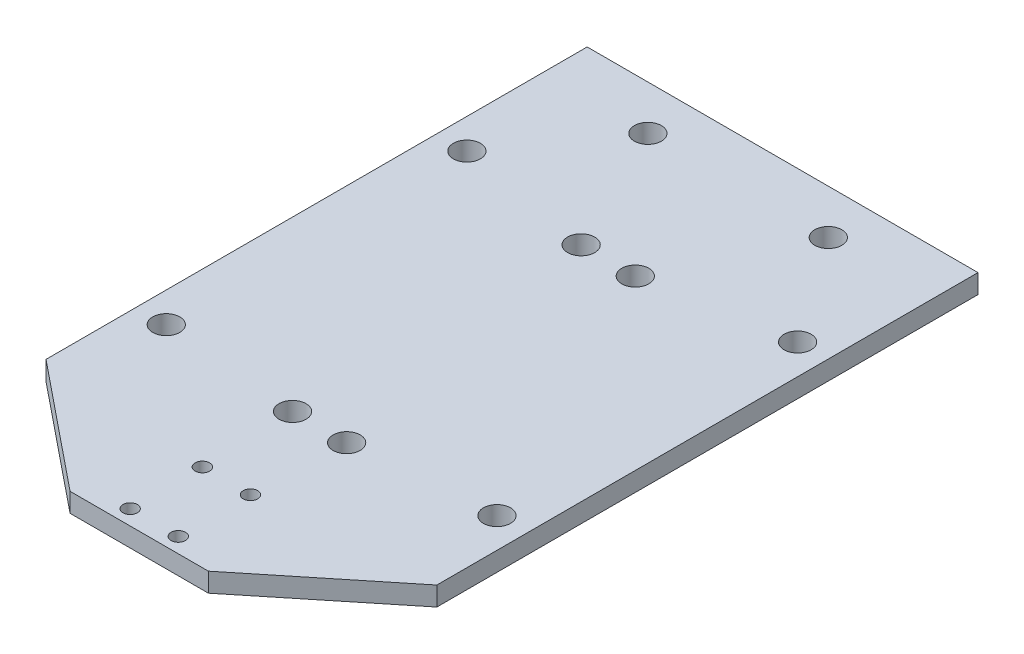
ISO-10303-21;
HEADER;
FILE_DESCRIPTION(('STEP AP214'),'2;1');
FILE_NAME('part.step','',(''),(''),'','','');
FILE_SCHEMA(('AUTOMOTIVE_DESIGN { 1 0 10303 214 1 1 1 1 }'));
ENDSEC;
DATA;
#1=APPLICATION_CONTEXT('core data for automotive mechanical design processes');
#2=APPLICATION_PROTOCOL_DEFINITION('international standard','automotive_design',2000,#1);
#3=PRODUCT_CONTEXT('',#1,'mechanical');
#4=PRODUCT('Part','Part','',(#3));
#5=PRODUCT_RELATED_PRODUCT_CATEGORY('part','',(#4));
#6=PRODUCT_DEFINITION_FORMATION('','',#4);
#7=PRODUCT_DEFINITION_CONTEXT('part definition',#1,'design');
#8=PRODUCT_DEFINITION('design','',#6,#7);
#9=PRODUCT_DEFINITION_SHAPE('','',#8);
#10=(LENGTH_UNIT() NAMED_UNIT(*) SI_UNIT(.MILLI.,.METRE.));
#11=(NAMED_UNIT(*) PLANE_ANGLE_UNIT() SI_UNIT($,.RADIAN.));
#12=(NAMED_UNIT(*) SI_UNIT($,.STERADIAN.) SOLID_ANGLE_UNIT());
#13=UNCERTAINTY_MEASURE_WITH_UNIT(LENGTH_MEASURE(1.E-05),#10,'distance_accuracy_value','');
#14=(GEOMETRIC_REPRESENTATION_CONTEXT(3) GLOBAL_UNCERTAINTY_ASSIGNED_CONTEXT((#13)) GLOBAL_UNIT_ASSIGNED_CONTEXT((#10,
#11,#12)) REPRESENTATION_CONTEXT('',''));
#15=CARTESIAN_POINT('',(0.,0.,0.));
#16=DIRECTION('',(0.,0.,1.));
#17=DIRECTION('',(1.,0.,0.));
#18=AXIS2_PLACEMENT_3D('',#15,#16,#17);
#19=CARTESIAN_POINT('',(0.,1.5875,62.));
#20=DIRECTION('',(0.,0.,-1.));
#21=DIRECTION('',(-1.,0.,0.));
#22=AXIS2_PLACEMENT_3D('',#19,#20,#21);
#23=PLANE('',#22);
#24=DIRECTION('',(1.,0.,0.));
#25=VECTOR('',#24,1.);
#26=CARTESIAN_POINT('',(0.,-1.5875,62.));
#27=LINE('',#26,#25);
#28=CARTESIAN_POINT('',(-11.5,-1.5875,62.));
#29=VERTEX_POINT('',#28);
#30=CARTESIAN_POINT('',(11.5,-1.5875,62.));
#31=VERTEX_POINT('',#30);
#32=EDGE_CURVE('E128',#29,#31,#27,.T.);
#33=ORIENTED_EDGE('',*,*,#32,.T.);
#34=DIRECTION('',(0.,-1.,0.));
#35=VECTOR('',#34,1.);
#36=CARTESIAN_POINT('',(11.5,1.5875,62.));
#37=LINE('',#36,#35);
#38=CARTESIAN_POINT('',(11.5,1.5875,62.));
#39=VERTEX_POINT('',#38);
#40=EDGE_CURVE('E11',#39,#31,#37,.T.);
#41=ORIENTED_EDGE('',*,*,#40,.F.);
#42=DIRECTION('',(1.,0.,0.));
#43=VECTOR('',#42,1.);
#44=CARTESIAN_POINT('',(0.,1.5875,62.));
#45=LINE('',#44,#43);
#46=CARTESIAN_POINT('',(-11.5,1.5875,62.));
#47=VERTEX_POINT('',#46);
#48=EDGE_CURVE('E141',#47,#39,#45,.T.);
#49=ORIENTED_EDGE('',*,*,#48,.F.);
#50=DIRECTION('',(0.,-1.,0.));
#51=VECTOR('',#50,1.);
#52=CARTESIAN_POINT('',(-11.5,1.5875,62.));
#53=LINE('',#52,#51);
#54=EDGE_CURVE('E59',#47,#29,#53,.T.);
#55=ORIENTED_EDGE('',*,*,#54,.T.);
#56=EDGE_LOOP('',(#33,#41,#49,#55));
#57=FACE_BOUND('',#56,.T.);
#58=ADVANCED_FACE('F43',(#57),#23,.F.);
#59=CARTESIAN_POINT('',(34.8732876712329,1.5875,43.0787671232877));
#60=DIRECTION('',(-0.629198228667964,0.,-0.777244870707486));
#61=DIRECTION('',(-0.777244870707486,0.,0.629198228667964));
#62=AXIS2_PLACEMENT_3D('',#59,#60,#61);
#63=PLANE('',#62);
#64=DIRECTION('',(0.777244870707486,0.,-0.629198228667964));
#65=VECTOR('',#64,1.);
#66=CARTESIAN_POINT('',(34.8732876712329,-1.5875,43.0787671232877));
#67=LINE('',#66,#65);
#68=CARTESIAN_POINT('',(32.5,-1.5875,45.));
#69=VERTEX_POINT('',#68);
#70=EDGE_CURVE('E130',#31,#69,#67,.T.);
#71=ORIENTED_EDGE('',*,*,#70,.T.);
#72=DIRECTION('',(0.,-1.,0.));
#73=VECTOR('',#72,1.);
#74=CARTESIAN_POINT('',(32.5,1.5875,45.));
#75=LINE('',#74,#73);
#76=CARTESIAN_POINT('',(32.5,1.5875,45.));
#77=VERTEX_POINT('',#76);
#78=EDGE_CURVE('E51',#77,#69,#75,.T.);
#79=ORIENTED_EDGE('',*,*,#78,.F.);
#80=DIRECTION('',(0.777244870707486,0.,-0.629198228667964));
#81=VECTOR('',#80,1.);
#82=CARTESIAN_POINT('',(34.8732876712329,1.5875,43.0787671232877));
#83=LINE('',#82,#81);
#84=EDGE_CURVE('E91',#39,#77,#83,.T.);
#85=ORIENTED_EDGE('',*,*,#84,.F.);
#86=ORIENTED_EDGE('',*,*,#40,.T.);
#87=EDGE_LOOP('',(#71,#79,#85,#86));
#88=FACE_BOUND('',#87,.T.);
#89=ADVANCED_FACE('F163',(#88),#63,.F.);
#90=CARTESIAN_POINT('',(32.5,1.5875,0.));
#91=DIRECTION('',(-1.,0.,0.));
#92=DIRECTION('',(0.,0.,1.));
#93=AXIS2_PLACEMENT_3D('',#90,#91,#92);
#94=PLANE('',#93);
#95=DIRECTION('',(0.,0.,-1.));
#96=VECTOR('',#95,1.);
#97=CARTESIAN_POINT('',(32.5,-1.5875,0.));
#98=LINE('',#97,#96);
#99=CARTESIAN_POINT('',(32.5,-1.5875,-45.));
#100=VERTEX_POINT('',#99);
#101=EDGE_CURVE('E133',#69,#100,#98,.T.);
#102=ORIENTED_EDGE('',*,*,#101,.T.);
#103=DIRECTION('',(0.,-1.,0.));
#104=VECTOR('',#103,1.);
#105=CARTESIAN_POINT('',(32.5,1.5875,-45.));
#106=LINE('',#105,#104);
#107=CARTESIAN_POINT('',(32.5,1.5875,-45.));
#108=VERTEX_POINT('',#107);
#109=EDGE_CURVE('E120',#108,#100,#106,.T.);
#110=ORIENTED_EDGE('',*,*,#109,.F.);
#111=DIRECTION('',(0.,0.,-1.));
#112=VECTOR('',#111,1.);
#113=CARTESIAN_POINT('',(32.5,1.5875,0.));
#114=LINE('',#113,#112);
#115=EDGE_CURVE('E108',#77,#108,#114,.T.);
#116=ORIENTED_EDGE('',*,*,#115,.F.);
#117=ORIENTED_EDGE('',*,*,#78,.T.);
#118=EDGE_LOOP('',(#102,#110,#116,#117));
#119=FACE_BOUND('',#118,.T.);
#120=ADVANCED_FACE('F147',(#119),#94,.F.);
#121=CARTESIAN_POINT('',(0.,1.5875,-45.));
#122=DIRECTION('',(0.,0.,1.));
#123=DIRECTION('',(1.,0.,0.));
#124=AXIS2_PLACEMENT_3D('',#121,#122,#123);
#125=PLANE('',#124);
#126=DIRECTION('',(-1.,0.,0.));
#127=VECTOR('',#126,1.);
#128=CARTESIAN_POINT('',(0.,-1.5875,-45.));
#129=LINE('',#128,#127);
#130=CARTESIAN_POINT('',(-32.5,-1.5875,-45.));
#131=VERTEX_POINT('',#130);
#132=EDGE_CURVE('E117',#100,#131,#129,.T.);
#133=ORIENTED_EDGE('',*,*,#132,.T.);
#134=DIRECTION('',(0.,-1.,0.));
#135=VECTOR('',#134,1.);
#136=CARTESIAN_POINT('',(-32.5,1.5875,-45.));
#137=LINE('',#136,#135);
#138=CARTESIAN_POINT('',(-32.5,1.5875,-45.));
#139=VERTEX_POINT('',#138);
#140=EDGE_CURVE('E114',#139,#131,#137,.T.);
#141=ORIENTED_EDGE('',*,*,#140,.F.);
#142=DIRECTION('',(-1.,0.,0.));
#143=VECTOR('',#142,1.);
#144=CARTESIAN_POINT('',(0.,1.5875,-45.));
#145=LINE('',#144,#143);
#146=EDGE_CURVE('E101',#108,#139,#145,.T.);
#147=ORIENTED_EDGE('',*,*,#146,.F.);
#148=ORIENTED_EDGE('',*,*,#109,.T.);
#149=EDGE_LOOP('',(#133,#141,#147,#148));
#150=FACE_BOUND('',#149,.T.);
#151=ADVANCED_FACE('F115',(#150),#125,.F.);
#152=CARTESIAN_POINT('',(-32.5,1.5875,0.));
#153=DIRECTION('',(-1.,0.,0.));
#154=DIRECTION('',(0.,0.,1.));
#155=AXIS2_PLACEMENT_3D('',#152,#153,#154);
#156=PLANE('',#155);
#157=DIRECTION('',(0.,0.,-1.));
#158=VECTOR('',#157,1.);
#159=CARTESIAN_POINT('',(-32.5,-1.5875,0.));
#160=LINE('',#159,#158);
#161=CARTESIAN_POINT('',(-32.5,-1.5875,45.));
#162=VERTEX_POINT('',#161);
#163=EDGE_CURVE('E136',#162,#131,#160,.T.);
#164=ORIENTED_EDGE('',*,*,#163,.F.);
#165=DIRECTION('',(0.,-1.,0.));
#166=VECTOR('',#165,1.);
#167=CARTESIAN_POINT('',(-32.5,1.5875,45.));
#168=LINE('',#167,#166);
#169=CARTESIAN_POINT('',(-32.5,1.5875,45.));
#170=VERTEX_POINT('',#169);
#171=EDGE_CURVE('E79',#170,#162,#168,.T.);
#172=ORIENTED_EDGE('',*,*,#171,.F.);
#173=DIRECTION('',(0.,0.,-1.));
#174=VECTOR('',#173,1.);
#175=CARTESIAN_POINT('',(-32.5,1.5875,0.));
#176=LINE('',#175,#174);
#177=EDGE_CURVE('E106',#170,#139,#176,.T.);
#178=ORIENTED_EDGE('',*,*,#177,.T.);
#179=ORIENTED_EDGE('',*,*,#140,.T.);
#180=EDGE_LOOP('',(#164,#172,#178,#179));
#181=FACE_BOUND('',#180,.T.);
#182=ADVANCED_FACE('F122',(#181),#156,.T.);
#183=CARTESIAN_POINT('',(-34.8732876712329,1.5875,43.0787671232876));
#184=DIRECTION('',(-0.629198228667965,0.,0.777244870707485));
#185=DIRECTION('',(0.777244870707485,0.,0.629198228667965));
#186=AXIS2_PLACEMENT_3D('',#183,#184,#185);
#187=PLANE('',#186);
#188=DIRECTION('',(-0.777244870707485,0.,-0.629198228667965));
#189=VECTOR('',#188,1.);
#190=CARTESIAN_POINT('',(-34.8732876712329,-1.5875,43.0787671232876));
#191=LINE('',#190,#189);
#192=EDGE_CURVE('E138',#29,#162,#191,.T.);
#193=ORIENTED_EDGE('',*,*,#192,.F.);
#194=ORIENTED_EDGE('',*,*,#54,.F.);
#195=DIRECTION('',(-0.777244870707485,0.,-0.629198228667965));
#196=VECTOR('',#195,1.);
#197=CARTESIAN_POINT('',(-34.8732876712329,1.5875,43.0787671232876));
#198=LINE('',#197,#196);
#199=EDGE_CURVE('E123',#47,#170,#198,.T.);
#200=ORIENTED_EDGE('',*,*,#199,.T.);
#201=ORIENTED_EDGE('',*,*,#171,.T.);
#202=EDGE_LOOP('',(#193,#194,#200,#201));
#203=FACE_BOUND('',#202,.T.);
#204=ADVANCED_FACE('F150',(#203),#187,.T.);
#205=CARTESIAN_POINT('',(0.,1.5875,0.));
#206=DIRECTION('',(0.,1.,0.));
#207=DIRECTION('',(0.,0.,1.));
#208=AXIS2_PLACEMENT_3D('',#205,#206,#207);
#209=PLANE('',#208);
#210=CARTESIAN_POINT('',(15.,1.5875,-37.6));
#211=DIRECTION('',(0.,1.,0.));
#212=DIRECTION('',(0.,0.,1.));
#213=AXIS2_PLACEMENT_3D('',#210,#211,#212);
#214=CIRCLE('',#213,2.24999999999999);
#215=CARTESIAN_POINT('',(15.,1.5875,-35.35));
#216=VERTEX_POINT('',#215);
#217=EDGE_CURVE('E251',#216,#216,#214,.T.);
#218=ORIENTED_EDGE('',*,*,#217,.F.);
#219=EDGE_LOOP('',(#218));
#220=FACE_BOUND('',#219,.T.);
#221=CARTESIAN_POINT('',(-15.,1.5875,-37.6));
#222=DIRECTION('',(0.,1.,0.));
#223=DIRECTION('',(0.,0.,1.));
#224=AXIS2_PLACEMENT_3D('',#221,#222,#223);
#225=CIRCLE('',#224,2.24999999999999);
#226=CARTESIAN_POINT('',(-15.,1.5875,-35.35));
#227=VERTEX_POINT('',#226);
#228=EDGE_CURVE('E245',#227,#227,#225,.T.);
#229=ORIENTED_EDGE('',*,*,#228,.F.);
#230=EDGE_LOOP('',(#229));
#231=FACE_BOUND('',#230,.T.);
#232=CARTESIAN_POINT('',(-4.50000000000001,1.5875,32.));
#233=DIRECTION('',(0.,1.,0.));
#234=DIRECTION('',(0.,0.,1.));
#235=AXIS2_PLACEMENT_3D('',#232,#233,#234);
#236=CIRCLE('',#235,2.25);
#237=CARTESIAN_POINT('',(-4.50000000000001,1.5875,34.25));
#238=VERTEX_POINT('',#237);
#239=EDGE_CURVE('E239',#238,#238,#236,.T.);
#240=ORIENTED_EDGE('',*,*,#239,.F.);
#241=EDGE_LOOP('',(#240));
#242=FACE_BOUND('',#241,.T.);
#243=CARTESIAN_POINT('',(4.49999999999999,1.5875,32.));
#244=DIRECTION('',(0.,1.,0.));
#245=DIRECTION('',(0.,0.,1.));
#246=AXIS2_PLACEMENT_3D('',#243,#244,#245);
#247=CIRCLE('',#246,2.25);
#248=CARTESIAN_POINT('',(4.49999999999999,1.5875,34.25));
#249=VERTEX_POINT('',#248);
#250=EDGE_CURVE('E233',#249,#249,#247,.T.);
#251=ORIENTED_EDGE('',*,*,#250,.F.);
#252=EDGE_LOOP('',(#251));
#253=FACE_BOUND('',#252,.T.);
#254=CARTESIAN_POINT('',(4.49999999999999,1.5875,-16.));
#255=DIRECTION('',(0.,1.,0.));
#256=DIRECTION('',(0.,0.,1.));
#257=AXIS2_PLACEMENT_3D('',#254,#255,#256);
#258=CIRCLE('',#257,2.25);
#259=CARTESIAN_POINT('',(4.49999999999999,1.5875,-13.75));
#260=VERTEX_POINT('',#259);
#261=EDGE_CURVE('E227',#260,#260,#258,.T.);
#262=ORIENTED_EDGE('',*,*,#261,.F.);
#263=EDGE_LOOP('',(#262));
#264=FACE_BOUND('',#263,.T.);
#265=CARTESIAN_POINT('',(-4.50000000000001,1.5875,-16.));
#266=DIRECTION('',(0.,1.,0.));
#267=DIRECTION('',(0.,0.,1.));
#268=AXIS2_PLACEMENT_3D('',#265,#266,#267);
#269=CIRCLE('',#268,2.25);
#270=CARTESIAN_POINT('',(-4.50000000000001,1.5875,-13.75));
#271=VERTEX_POINT('',#270);
#272=EDGE_CURVE('E221',#271,#271,#269,.T.);
#273=ORIENTED_EDGE('',*,*,#272,.F.);
#274=EDGE_LOOP('',(#273));
#275=FACE_BOUND('',#274,.T.);
#276=CARTESIAN_POINT('',(-27.5,1.5875,-20.));
#277=DIRECTION('',(0.,1.,0.));
#278=DIRECTION('',(0.,0.,1.));
#279=AXIS2_PLACEMENT_3D('',#276,#277,#278);
#280=CIRCLE('',#279,2.24999999999999);
#281=CARTESIAN_POINT('',(-27.5,1.5875,-17.75));
#282=VERTEX_POINT('',#281);
#283=EDGE_CURVE('E215',#282,#282,#280,.T.);
#284=ORIENTED_EDGE('',*,*,#283,.F.);
#285=EDGE_LOOP('',(#284));
#286=FACE_BOUND('',#285,.T.);
#287=CARTESIAN_POINT('',(27.5,1.5875,-20.));
#288=DIRECTION('',(0.,1.,0.));
#289=DIRECTION('',(0.,0.,1.));
#290=AXIS2_PLACEMENT_3D('',#287,#288,#289);
#291=CIRCLE('',#290,2.24999999999999);
#292=CARTESIAN_POINT('',(27.5,1.5875,-17.75));
#293=VERTEX_POINT('',#292);
#294=EDGE_CURVE('E209',#293,#293,#291,.T.);
#295=ORIENTED_EDGE('',*,*,#294,.F.);
#296=EDGE_LOOP('',(#295));
#297=FACE_BOUND('',#296,.T.);
#298=CARTESIAN_POINT('',(27.5,1.5875,30.));
#299=DIRECTION('',(0.,1.,0.));
#300=DIRECTION('',(0.,0.,1.));
#301=AXIS2_PLACEMENT_3D('',#298,#299,#300);
#302=CIRCLE('',#301,2.24999999999999);
#303=CARTESIAN_POINT('',(27.5,1.5875,32.25));
#304=VERTEX_POINT('',#303);
#305=EDGE_CURVE('E203',#304,#304,#302,.T.);
#306=ORIENTED_EDGE('',*,*,#305,.F.);
#307=EDGE_LOOP('',(#306));
#308=FACE_BOUND('',#307,.T.);
#309=CARTESIAN_POINT('',(-27.5,1.5875,30.));
#310=DIRECTION('',(0.,1.,0.));
#311=DIRECTION('',(0.,0.,1.));
#312=AXIS2_PLACEMENT_3D('',#309,#310,#311);
#313=CIRCLE('',#312,2.24999999999999);
#314=CARTESIAN_POINT('',(-27.5,1.5875,32.25));
#315=VERTEX_POINT('',#314);
#316=EDGE_CURVE('E197',#315,#315,#313,.T.);
#317=ORIENTED_EDGE('',*,*,#316,.F.);
#318=EDGE_LOOP('',(#317));
#319=FACE_BOUND('',#318,.T.);
#320=CARTESIAN_POINT('',(-3.99999999999999,1.5875,59.5));
#321=DIRECTION('',(0.,1.,0.));
#322=DIRECTION('',(0.,0.,1.));
#323=AXIS2_PLACEMENT_3D('',#320,#321,#322);
#324=CIRCLE('',#323,1.2);
#325=CARTESIAN_POINT('',(-3.99999999999999,1.5875,60.7));
#326=VERTEX_POINT('',#325);
#327=EDGE_CURVE('E191',#326,#326,#324,.T.);
#328=ORIENTED_EDGE('',*,*,#327,.F.);
#329=EDGE_LOOP('',(#328));
#330=FACE_BOUND('',#329,.T.);
#331=CARTESIAN_POINT('',(3.99999999999999,1.5875,59.5));
#332=DIRECTION('',(0.,1.,0.));
#333=DIRECTION('',(0.,0.,1.));
#334=AXIS2_PLACEMENT_3D('',#331,#332,#333);
#335=CIRCLE('',#334,1.2);
#336=CARTESIAN_POINT('',(3.99999999999999,1.5875,60.7));
#337=VERTEX_POINT('',#336);
#338=EDGE_CURVE('E185',#337,#337,#335,.T.);
#339=ORIENTED_EDGE('',*,*,#338,.F.);
#340=EDGE_LOOP('',(#339));
#341=FACE_BOUND('',#340,.T.);
#342=CARTESIAN_POINT('',(3.99999999999999,1.5875,47.5));
#343=DIRECTION('',(0.,1.,0.));
#344=DIRECTION('',(0.,0.,1.));
#345=AXIS2_PLACEMENT_3D('',#342,#343,#344);
#346=CIRCLE('',#345,1.2);
#347=CARTESIAN_POINT('',(3.99999999999999,1.5875,48.7));
#348=VERTEX_POINT('',#347);
#349=EDGE_CURVE('E179',#348,#348,#346,.T.);
#350=ORIENTED_EDGE('',*,*,#349,.F.);
#351=EDGE_LOOP('',(#350));
#352=FACE_BOUND('',#351,.T.);
#353=CARTESIAN_POINT('',(-3.99999999999999,1.5875,47.5));
#354=DIRECTION('',(0.,1.,0.));
#355=DIRECTION('',(0.,0.,1.));
#356=AXIS2_PLACEMENT_3D('',#353,#354,#355);
#357=CIRCLE('',#356,1.2);
#358=CARTESIAN_POINT('',(-3.99999999999999,1.5875,48.7));
#359=VERTEX_POINT('',#358);
#360=EDGE_CURVE('E173',#359,#359,#357,.T.);
#361=ORIENTED_EDGE('',*,*,#360,.F.);
#362=EDGE_LOOP('',(#361));
#363=FACE_BOUND('',#362,.T.);
#364=ORIENTED_EDGE('',*,*,#48,.T.);
#365=ORIENTED_EDGE('',*,*,#84,.T.);
#366=ORIENTED_EDGE('',*,*,#115,.T.);
#367=ORIENTED_EDGE('',*,*,#146,.T.);
#368=ORIENTED_EDGE('',*,*,#177,.F.);
#369=ORIENTED_EDGE('',*,*,#199,.F.);
#370=EDGE_LOOP('',(#364,#365,#366,#367,#368,#369));
#371=FACE_BOUND('',#370,.T.);
#372=ADVANCED_FACE('F103',(#220,#231,#242,#253,#264,#275,#286,#297,#308,#319,#330,#341,#352,
#363,#371),#209,.T.);
#373=CARTESIAN_POINT('',(0.,-1.5875,0.));
#374=DIRECTION('',(0.,1.,0.));
#375=DIRECTION('',(0.,0.,1.));
#376=AXIS2_PLACEMENT_3D('',#373,#374,#375);
#377=PLANE('',#376);
#378=CARTESIAN_POINT('',(15.,-1.5875,-37.6));
#379=DIRECTION('',(0.,1.,0.));
#380=DIRECTION('',(0.,0.,1.));
#381=AXIS2_PLACEMENT_3D('',#378,#379,#380);
#382=CIRCLE('',#381,2.25);
#383=CARTESIAN_POINT('',(15.,-1.5875,-35.35));
#384=VERTEX_POINT('',#383);
#385=EDGE_CURVE('E248',#384,#384,#382,.T.);
#386=ORIENTED_EDGE('',*,*,#385,.T.);
#387=EDGE_LOOP('',(#386));
#388=FACE_BOUND('',#387,.T.);
#389=CARTESIAN_POINT('',(-15.,-1.5875,-37.6));
#390=DIRECTION('',(0.,1.,0.));
#391=DIRECTION('',(0.,0.,1.));
#392=AXIS2_PLACEMENT_3D('',#389,#390,#391);
#393=CIRCLE('',#392,2.25);
#394=CARTESIAN_POINT('',(-15.,-1.5875,-35.35));
#395=VERTEX_POINT('',#394);
#396=EDGE_CURVE('E242',#395,#395,#393,.T.);
#397=ORIENTED_EDGE('',*,*,#396,.T.);
#398=EDGE_LOOP('',(#397));
#399=FACE_BOUND('',#398,.T.);
#400=CARTESIAN_POINT('',(-4.50000000000001,-1.5875,32.));
#401=DIRECTION('',(0.,1.,0.));
#402=DIRECTION('',(0.,0.,1.));
#403=AXIS2_PLACEMENT_3D('',#400,#401,#402);
#404=CIRCLE('',#403,2.25);
#405=CARTESIAN_POINT('',(-4.50000000000001,-1.5875,34.25));
#406=VERTEX_POINT('',#405);
#407=EDGE_CURVE('E236',#406,#406,#404,.T.);
#408=ORIENTED_EDGE('',*,*,#407,.T.);
#409=EDGE_LOOP('',(#408));
#410=FACE_BOUND('',#409,.T.);
#411=CARTESIAN_POINT('',(4.49999999999999,-1.5875,32.));
#412=DIRECTION('',(0.,1.,0.));
#413=DIRECTION('',(0.,0.,1.));
#414=AXIS2_PLACEMENT_3D('',#411,#412,#413);
#415=CIRCLE('',#414,2.25);
#416=CARTESIAN_POINT('',(4.49999999999999,-1.5875,34.25));
#417=VERTEX_POINT('',#416);
#418=EDGE_CURVE('E230',#417,#417,#415,.T.);
#419=ORIENTED_EDGE('',*,*,#418,.T.);
#420=EDGE_LOOP('',(#419));
#421=FACE_BOUND('',#420,.T.);
#422=CARTESIAN_POINT('',(4.49999999999999,-1.5875,-16.));
#423=DIRECTION('',(0.,1.,0.));
#424=DIRECTION('',(0.,0.,1.));
#425=AXIS2_PLACEMENT_3D('',#422,#423,#424);
#426=CIRCLE('',#425,2.25);
#427=CARTESIAN_POINT('',(4.49999999999999,-1.5875,-13.75));
#428=VERTEX_POINT('',#427);
#429=EDGE_CURVE('E224',#428,#428,#426,.T.);
#430=ORIENTED_EDGE('',*,*,#429,.T.);
#431=EDGE_LOOP('',(#430));
#432=FACE_BOUND('',#431,.T.);
#433=CARTESIAN_POINT('',(-4.50000000000001,-1.5875,-16.));
#434=DIRECTION('',(0.,1.,0.));
#435=DIRECTION('',(0.,0.,1.));
#436=AXIS2_PLACEMENT_3D('',#433,#434,#435);
#437=CIRCLE('',#436,2.25);
#438=CARTESIAN_POINT('',(-4.50000000000001,-1.5875,-13.75));
#439=VERTEX_POINT('',#438);
#440=EDGE_CURVE('E218',#439,#439,#437,.T.);
#441=ORIENTED_EDGE('',*,*,#440,.T.);
#442=EDGE_LOOP('',(#441));
#443=FACE_BOUND('',#442,.T.);
#444=CARTESIAN_POINT('',(-27.5,-1.5875,-20.));
#445=DIRECTION('',(0.,1.,0.));
#446=DIRECTION('',(0.,0.,1.));
#447=AXIS2_PLACEMENT_3D('',#444,#445,#446);
#448=CIRCLE('',#447,2.25);
#449=CARTESIAN_POINT('',(-27.5,-1.5875,-17.75));
#450=VERTEX_POINT('',#449);
#451=EDGE_CURVE('E212',#450,#450,#448,.T.);
#452=ORIENTED_EDGE('',*,*,#451,.T.);
#453=EDGE_LOOP('',(#452));
#454=FACE_BOUND('',#453,.T.);
#455=CARTESIAN_POINT('',(27.5,-1.5875,-20.));
#456=DIRECTION('',(0.,1.,0.));
#457=DIRECTION('',(0.,0.,1.));
#458=AXIS2_PLACEMENT_3D('',#455,#456,#457);
#459=CIRCLE('',#458,2.25);
#460=CARTESIAN_POINT('',(27.5,-1.5875,-17.75));
#461=VERTEX_POINT('',#460);
#462=EDGE_CURVE('E206',#461,#461,#459,.T.);
#463=ORIENTED_EDGE('',*,*,#462,.T.);
#464=EDGE_LOOP('',(#463));
#465=FACE_BOUND('',#464,.T.);
#466=CARTESIAN_POINT('',(27.5,-1.5875,30.));
#467=DIRECTION('',(0.,1.,0.));
#468=DIRECTION('',(0.,0.,1.));
#469=AXIS2_PLACEMENT_3D('',#466,#467,#468);
#470=CIRCLE('',#469,2.25);
#471=CARTESIAN_POINT('',(27.5,-1.5875,32.25));
#472=VERTEX_POINT('',#471);
#473=EDGE_CURVE('E200',#472,#472,#470,.T.);
#474=ORIENTED_EDGE('',*,*,#473,.T.);
#475=EDGE_LOOP('',(#474));
#476=FACE_BOUND('',#475,.T.);
#477=CARTESIAN_POINT('',(-27.5,-1.5875,30.));
#478=DIRECTION('',(0.,1.,0.));
#479=DIRECTION('',(0.,0.,1.));
#480=AXIS2_PLACEMENT_3D('',#477,#478,#479);
#481=CIRCLE('',#480,2.25);
#482=CARTESIAN_POINT('',(-27.5,-1.5875,32.25));
#483=VERTEX_POINT('',#482);
#484=EDGE_CURVE('E194',#483,#483,#481,.T.);
#485=ORIENTED_EDGE('',*,*,#484,.T.);
#486=EDGE_LOOP('',(#485));
#487=FACE_BOUND('',#486,.T.);
#488=CARTESIAN_POINT('',(-3.99999999999999,-1.5875,59.5));
#489=DIRECTION('',(0.,1.,0.));
#490=DIRECTION('',(0.,0.,1.));
#491=AXIS2_PLACEMENT_3D('',#488,#489,#490);
#492=CIRCLE('',#491,1.19999999999999);
#493=CARTESIAN_POINT('',(-3.99999999999999,-1.5875,60.7));
#494=VERTEX_POINT('',#493);
#495=EDGE_CURVE('E188',#494,#494,#492,.T.);
#496=ORIENTED_EDGE('',*,*,#495,.T.);
#497=EDGE_LOOP('',(#496));
#498=FACE_BOUND('',#497,.T.);
#499=CARTESIAN_POINT('',(3.99999999999999,-1.5875,59.5));
#500=DIRECTION('',(0.,1.,0.));
#501=DIRECTION('',(0.,0.,1.));
#502=AXIS2_PLACEMENT_3D('',#499,#500,#501);
#503=CIRCLE('',#502,1.19999999999999);
#504=CARTESIAN_POINT('',(3.99999999999999,-1.5875,60.7));
#505=VERTEX_POINT('',#504);
#506=EDGE_CURVE('E182',#505,#505,#503,.T.);
#507=ORIENTED_EDGE('',*,*,#506,.T.);
#508=EDGE_LOOP('',(#507));
#509=FACE_BOUND('',#508,.T.);
#510=CARTESIAN_POINT('',(3.99999999999999,-1.5875,47.5));
#511=DIRECTION('',(0.,1.,0.));
#512=DIRECTION('',(0.,0.,1.));
#513=AXIS2_PLACEMENT_3D('',#510,#511,#512);
#514=CIRCLE('',#513,1.19999999999999);
#515=CARTESIAN_POINT('',(3.99999999999999,-1.5875,48.7));
#516=VERTEX_POINT('',#515);
#517=EDGE_CURVE('E176',#516,#516,#514,.T.);
#518=ORIENTED_EDGE('',*,*,#517,.T.);
#519=EDGE_LOOP('',(#518));
#520=FACE_BOUND('',#519,.T.);
#521=CARTESIAN_POINT('',(-3.99999999999999,-1.5875,47.5));
#522=DIRECTION('',(0.,1.,0.));
#523=DIRECTION('',(0.,0.,1.));
#524=AXIS2_PLACEMENT_3D('',#521,#522,#523);
#525=CIRCLE('',#524,1.19999999999999);
#526=CARTESIAN_POINT('',(-3.99999999999999,-1.5875,48.7));
#527=VERTEX_POINT('',#526);
#528=EDGE_CURVE('E131',#527,#527,#525,.T.);
#529=ORIENTED_EDGE('',*,*,#528,.T.);
#530=EDGE_LOOP('',(#529));
#531=FACE_BOUND('',#530,.T.);
#532=ORIENTED_EDGE('',*,*,#32,.F.);
#533=ORIENTED_EDGE('',*,*,#192,.T.);
#534=ORIENTED_EDGE('',*,*,#163,.T.);
#535=ORIENTED_EDGE('',*,*,#132,.F.);
#536=ORIENTED_EDGE('',*,*,#101,.F.);
#537=ORIENTED_EDGE('',*,*,#70,.F.);
#538=EDGE_LOOP('',(#532,#533,#534,#535,#536,#537));
#539=FACE_BOUND('',#538,.T.);
#540=ADVANCED_FACE('F149',(#388,#399,#410,#421,#432,#443,#454,#465,#476,#487,#498,#509,#520,
#531,#539),#377,.F.);
#541=CARTESIAN_POINT('',(-3.99999999999999,1.5875,47.5));
#542=DIRECTION('',(0.,1.,0.));
#543=DIRECTION('',(0.,0.,1.));
#544=AXIS2_PLACEMENT_3D('',#541,#542,#543);
#545=CYLINDRICAL_SURFACE('',#544,1.19999999999999);
#546=ORIENTED_EDGE('',*,*,#528,.F.);
#547=EDGE_LOOP('',(#546));
#548=FACE_BOUND('',#547,.T.);
#549=ORIENTED_EDGE('',*,*,#360,.T.);
#550=EDGE_LOOP('',(#549));
#551=FACE_BOUND('',#550,.T.);
#552=ADVANCED_FACE('F283',(#548,#551),#545,.F.);
#553=CARTESIAN_POINT('',(3.99999999999999,1.5875,47.5));
#554=DIRECTION('',(0.,1.,0.));
#555=DIRECTION('',(0.,0.,1.));
#556=AXIS2_PLACEMENT_3D('',#553,#554,#555);
#557=CYLINDRICAL_SURFACE('',#556,1.19999999999999);
#558=ORIENTED_EDGE('',*,*,#517,.F.);
#559=EDGE_LOOP('',(#558));
#560=FACE_BOUND('',#559,.T.);
#561=ORIENTED_EDGE('',*,*,#349,.T.);
#562=EDGE_LOOP('',(#561));
#563=FACE_BOUND('',#562,.T.);
#564=ADVANCED_FACE('F284',(#560,#563),#557,.F.);
#565=CARTESIAN_POINT('',(3.99999999999999,1.5875,59.5));
#566=DIRECTION('',(0.,1.,0.));
#567=DIRECTION('',(0.,0.,1.));
#568=AXIS2_PLACEMENT_3D('',#565,#566,#567);
#569=CYLINDRICAL_SURFACE('',#568,1.19999999999999);
#570=ORIENTED_EDGE('',*,*,#506,.F.);
#571=EDGE_LOOP('',(#570));
#572=FACE_BOUND('',#571,.T.);
#573=ORIENTED_EDGE('',*,*,#338,.T.);
#574=EDGE_LOOP('',(#573));
#575=FACE_BOUND('',#574,.T.);
#576=ADVANCED_FACE('F290',(#572,#575),#569,.F.);
#577=CARTESIAN_POINT('',(-3.99999999999999,1.5875,59.5));
#578=DIRECTION('',(0.,1.,0.));
#579=DIRECTION('',(0.,0.,1.));
#580=AXIS2_PLACEMENT_3D('',#577,#578,#579);
#581=CYLINDRICAL_SURFACE('',#580,1.19999999999999);
#582=ORIENTED_EDGE('',*,*,#495,.F.);
#583=EDGE_LOOP('',(#582));
#584=FACE_BOUND('',#583,.T.);
#585=ORIENTED_EDGE('',*,*,#327,.T.);
#586=EDGE_LOOP('',(#585));
#587=FACE_BOUND('',#586,.T.);
#588=ADVANCED_FACE('F299',(#584,#587),#581,.F.);
#589=CARTESIAN_POINT('',(-27.5,1.5875,30.));
#590=DIRECTION('',(0.,1.,0.));
#591=DIRECTION('',(0.,0.,1.));
#592=AXIS2_PLACEMENT_3D('',#589,#590,#591);
#593=CYLINDRICAL_SURFACE('',#592,2.24999999999999);
#594=ORIENTED_EDGE('',*,*,#484,.F.);
#595=EDGE_LOOP('',(#594));
#596=FACE_BOUND('',#595,.T.);
#597=ORIENTED_EDGE('',*,*,#316,.T.);
#598=EDGE_LOOP('',(#597));
#599=FACE_BOUND('',#598,.T.);
#600=ADVANCED_FACE('F303',(#596,#599),#593,.F.);
#601=CARTESIAN_POINT('',(27.5,1.5875,30.));
#602=DIRECTION('',(0.,1.,0.));
#603=DIRECTION('',(0.,0.,1.));
#604=AXIS2_PLACEMENT_3D('',#601,#602,#603);
#605=CYLINDRICAL_SURFACE('',#604,2.24999999999999);
#606=ORIENTED_EDGE('',*,*,#473,.F.);
#607=EDGE_LOOP('',(#606));
#608=FACE_BOUND('',#607,.T.);
#609=ORIENTED_EDGE('',*,*,#305,.T.);
#610=EDGE_LOOP('',(#609));
#611=FACE_BOUND('',#610,.T.);
#612=ADVANCED_FACE('F307',(#608,#611),#605,.F.);
#613=CARTESIAN_POINT('',(27.5,1.5875,-20.));
#614=DIRECTION('',(0.,1.,0.));
#615=DIRECTION('',(0.,0.,1.));
#616=AXIS2_PLACEMENT_3D('',#613,#614,#615);
#617=CYLINDRICAL_SURFACE('',#616,2.24999999999999);
#618=ORIENTED_EDGE('',*,*,#462,.F.);
#619=EDGE_LOOP('',(#618));
#620=FACE_BOUND('',#619,.T.);
#621=ORIENTED_EDGE('',*,*,#294,.T.);
#622=EDGE_LOOP('',(#621));
#623=FACE_BOUND('',#622,.T.);
#624=ADVANCED_FACE('F311',(#620,#623),#617,.F.);
#625=CARTESIAN_POINT('',(-27.5,1.5875,-20.));
#626=DIRECTION('',(0.,1.,0.));
#627=DIRECTION('',(0.,0.,1.));
#628=AXIS2_PLACEMENT_3D('',#625,#626,#627);
#629=CYLINDRICAL_SURFACE('',#628,2.24999999999999);
#630=ORIENTED_EDGE('',*,*,#451,.F.);
#631=EDGE_LOOP('',(#630));
#632=FACE_BOUND('',#631,.T.);
#633=ORIENTED_EDGE('',*,*,#283,.T.);
#634=EDGE_LOOP('',(#633));
#635=FACE_BOUND('',#634,.T.);
#636=ADVANCED_FACE('F315',(#632,#635),#629,.F.);
#637=CARTESIAN_POINT('',(-4.50000000000001,1.5875,-16.));
#638=DIRECTION('',(0.,1.,0.));
#639=DIRECTION('',(0.,0.,1.));
#640=AXIS2_PLACEMENT_3D('',#637,#638,#639);
#641=CYLINDRICAL_SURFACE('',#640,2.25);
#642=ORIENTED_EDGE('',*,*,#440,.F.);
#643=EDGE_LOOP('',(#642));
#644=FACE_BOUND('',#643,.T.);
#645=ORIENTED_EDGE('',*,*,#272,.T.);
#646=EDGE_LOOP('',(#645));
#647=FACE_BOUND('',#646,.T.);
#648=ADVANCED_FACE('F319',(#644,#647),#641,.F.);
#649=CARTESIAN_POINT('',(4.49999999999999,1.5875,-16.));
#650=DIRECTION('',(0.,1.,0.));
#651=DIRECTION('',(0.,0.,1.));
#652=AXIS2_PLACEMENT_3D('',#649,#650,#651);
#653=CYLINDRICAL_SURFACE('',#652,2.25);
#654=ORIENTED_EDGE('',*,*,#429,.F.);
#655=EDGE_LOOP('',(#654));
#656=FACE_BOUND('',#655,.T.);
#657=ORIENTED_EDGE('',*,*,#261,.T.);
#658=EDGE_LOOP('',(#657));
#659=FACE_BOUND('',#658,.T.);
#660=ADVANCED_FACE('F323',(#656,#659),#653,.F.);
#661=CARTESIAN_POINT('',(4.49999999999999,1.5875,32.));
#662=DIRECTION('',(0.,1.,0.));
#663=DIRECTION('',(0.,0.,1.));
#664=AXIS2_PLACEMENT_3D('',#661,#662,#663);
#665=CYLINDRICAL_SURFACE('',#664,2.25);
#666=ORIENTED_EDGE('',*,*,#418,.F.);
#667=EDGE_LOOP('',(#666));
#668=FACE_BOUND('',#667,.T.);
#669=ORIENTED_EDGE('',*,*,#250,.T.);
#670=EDGE_LOOP('',(#669));
#671=FACE_BOUND('',#670,.T.);
#672=ADVANCED_FACE('F327',(#668,#671),#665,.F.);
#673=CARTESIAN_POINT('',(-4.50000000000001,1.5875,32.));
#674=DIRECTION('',(0.,1.,0.));
#675=DIRECTION('',(0.,0.,1.));
#676=AXIS2_PLACEMENT_3D('',#673,#674,#675);
#677=CYLINDRICAL_SURFACE('',#676,2.25);
#678=ORIENTED_EDGE('',*,*,#407,.F.);
#679=EDGE_LOOP('',(#678));
#680=FACE_BOUND('',#679,.T.);
#681=ORIENTED_EDGE('',*,*,#239,.T.);
#682=EDGE_LOOP('',(#681));
#683=FACE_BOUND('',#682,.T.);
#684=ADVANCED_FACE('F331',(#680,#683),#677,.F.);
#685=CARTESIAN_POINT('',(-15.,1.5875,-37.6));
#686=DIRECTION('',(0.,1.,0.));
#687=DIRECTION('',(0.,0.,1.));
#688=AXIS2_PLACEMENT_3D('',#685,#686,#687);
#689=CYLINDRICAL_SURFACE('',#688,2.24999999999999);
#690=ORIENTED_EDGE('',*,*,#396,.F.);
#691=EDGE_LOOP('',(#690));
#692=FACE_BOUND('',#691,.T.);
#693=ORIENTED_EDGE('',*,*,#228,.T.);
#694=EDGE_LOOP('',(#693));
#695=FACE_BOUND('',#694,.T.);
#696=ADVANCED_FACE('F335',(#692,#695),#689,.F.);
#697=CARTESIAN_POINT('',(15.,1.5875,-37.6));
#698=DIRECTION('',(0.,1.,0.));
#699=DIRECTION('',(0.,0.,1.));
#700=AXIS2_PLACEMENT_3D('',#697,#698,#699);
#701=CYLINDRICAL_SURFACE('',#700,2.24999999999999);
#702=ORIENTED_EDGE('',*,*,#385,.F.);
#703=EDGE_LOOP('',(#702));
#704=FACE_BOUND('',#703,.T.);
#705=ORIENTED_EDGE('',*,*,#217,.T.);
#706=EDGE_LOOP('',(#705));
#707=FACE_BOUND('',#706,.T.);
#708=ADVANCED_FACE('F255',(#704,#707),#701,.F.);
#709=CLOSED_SHELL('',(#58,#89,#120,#151,#182,#204,#372,#540,#552,#564,#576,#588,#600,#612,#624,
#636,#648,#660,#672,#684,#696,#708));
#710=MANIFOLD_SOLID_BREP('B2',#709);
#711=ADVANCED_BREP_SHAPE_REPRESENTATION('',(#18,#710),#14);
#712=SHAPE_DEFINITION_REPRESENTATION(#9,#711);
ENDSEC;
END-ISO-10303-21;
